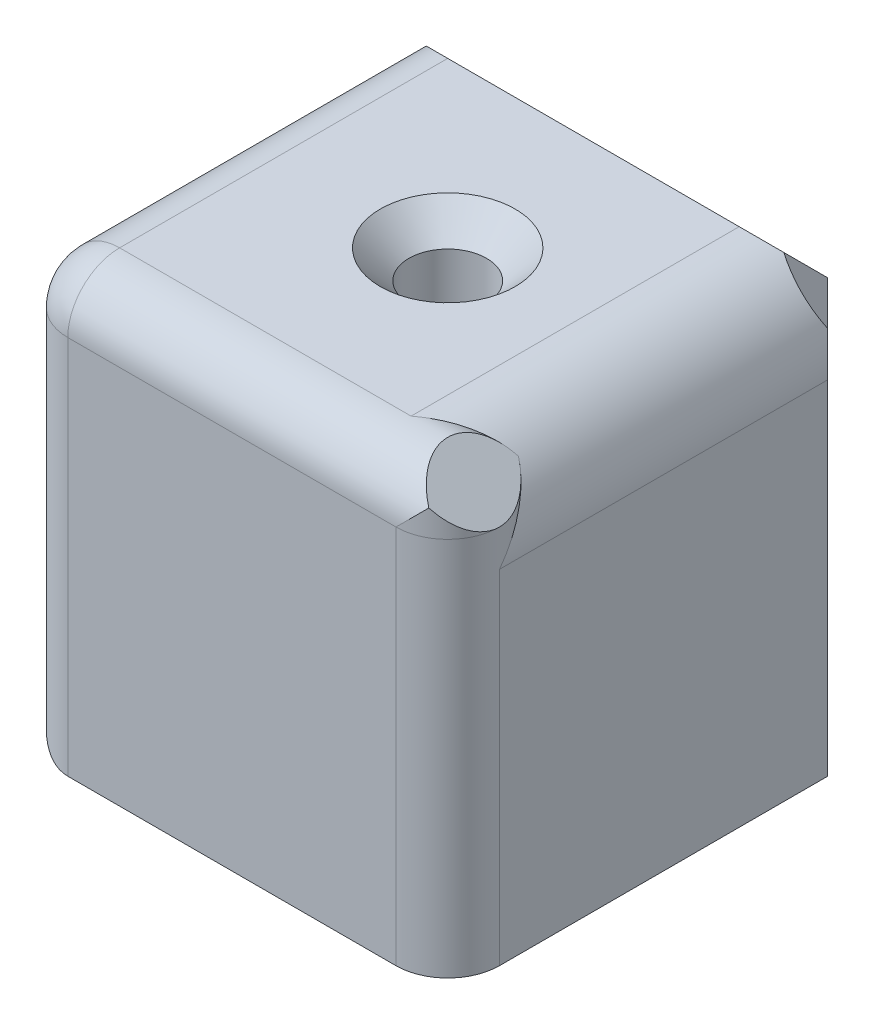
ISO-10303-21;
HEADER;
FILE_DESCRIPTION(('STEP AP214'),'2;1');
FILE_NAME('part.step','',(''),(''),'','','');
FILE_SCHEMA(('AUTOMOTIVE_DESIGN { 1 0 10303 214 1 1 1 1 }'));
ENDSEC;
DATA;
#1=APPLICATION_CONTEXT('core data for automotive mechanical design processes');
#2=APPLICATION_PROTOCOL_DEFINITION('international standard','automotive_design',2000,#1);
#3=PRODUCT_CONTEXT('',#1,'mechanical');
#4=PRODUCT('Part','Part','',(#3));
#5=PRODUCT_RELATED_PRODUCT_CATEGORY('part','',(#4));
#6=PRODUCT_DEFINITION_FORMATION('','',#4);
#7=PRODUCT_DEFINITION_CONTEXT('part definition',#1,'design');
#8=PRODUCT_DEFINITION('design','',#6,#7);
#9=PRODUCT_DEFINITION_SHAPE('','',#8);
#10=(LENGTH_UNIT() NAMED_UNIT(*) SI_UNIT(.MILLI.,.METRE.));
#11=(NAMED_UNIT(*) PLANE_ANGLE_UNIT() SI_UNIT($,.RADIAN.));
#12=(NAMED_UNIT(*) SI_UNIT($,.STERADIAN.) SOLID_ANGLE_UNIT());
#13=UNCERTAINTY_MEASURE_WITH_UNIT(LENGTH_MEASURE(1.E-05),#10,'distance_accuracy_value','');
#14=(GEOMETRIC_REPRESENTATION_CONTEXT(3) GLOBAL_UNCERTAINTY_ASSIGNED_CONTEXT((#13)) GLOBAL_UNIT_ASSIGNED_CONTEXT((#10,
#11,#12)) REPRESENTATION_CONTEXT('',''));
#15=CARTESIAN_POINT('',(0.,0.,0.));
#16=DIRECTION('',(0.,0.,1.));
#17=DIRECTION('',(1.,0.,0.));
#18=AXIS2_PLACEMENT_3D('',#15,#16,#17);
#19=CARTESIAN_POINT('',(19.8786796564403,19.8786796564403,22.));
#20=DIRECTION('',(0.,0.,-1.));
#21=DIRECTION('',(-1.,0.,0.));
#22=AXIS2_PLACEMENT_3D('',#19,#20,#21);
#23=CYLINDRICAL_SURFACE('',#22,5.12132034355965);
#24=CARTESIAN_POINT('',(25.,19.8786796564403,22.));
#25=CARTESIAN_POINT('',(24.9999999929722,19.8824681355446,21.9971004273422));
#26=CARTESIAN_POINT('',(24.9999957893406,19.88625672606,21.9942007656351));
#27=CARTESIAN_POINT('',(24.999199681778,20.2452694775159,21.7194243142326));
#28=CARTESIAN_POINT('',(24.9615105083884,20.601418757666,21.4468411862931));
#29=CARTESIAN_POINT('',(24.8480307816382,21.1301371370946,21.0471031769414));
#30=CARTESIAN_POINT('',(24.8005575269931,21.3058123453278,20.9151196451383));
#31=CARTESIAN_POINT('',(24.6858586342572,21.6542241467728,20.6560457121009));
#32=CARTESIAN_POINT('',(24.6186453894285,21.8269625120411,20.5289522971814));
#33=CARTESIAN_POINT('',(24.4375602877326,22.2254018981608,20.240386083954));
#34=CARTESIAN_POINT('',(24.3156025682009,22.4495250301366,20.0816065124527));
#35=CARTESIAN_POINT('',(24.1036185137131,22.776009364585,19.8586901161403));
#36=CARTESIAN_POINT('',(24.0283313726079,22.882975285724,19.7870807159734));
#37=CARTESIAN_POINT('',(23.8677172932172,23.0931800405642,19.6499372777481));
#38=CARTESIAN_POINT('',(23.7823919522402,23.1964194638296,19.5844022760725));
#39=CARTESIAN_POINT('',(23.5585439900387,23.4460767459297,19.4315414901501));
#40=CARTESIAN_POINT('',(23.4139270543383,23.5898634627181,19.3485389278986));
#41=CARTESIAN_POINT('',(23.1796178565418,23.7956526913762,19.2402916061685));
#42=CARTESIAN_POINT('',(23.0982158111705,23.8628774086252,19.206806389846));
#43=CARTESIAN_POINT('',(22.9297661784687,23.9933077166903,19.1463104846576));
#44=CARTESIAN_POINT('',(22.8427101369166,24.0565069953208,19.1193097888533));
#45=CARTESIAN_POINT('',(22.7529599066656,24.117362836925,19.0960283439823));
#46=B_SPLINE_CURVE_WITH_KNOTS('',3,(#24,#25,#26,#27,#28,#29,#30,#31,#32,#33,#34,#35,#36,#37,#38,
#39,#40,#41,#42,#43,#44,#45),.UNSPECIFIED.,.F.,.F.,(4,2,2,2,2,2,2,2,2,2,4),(0.,
0.0143126857300201,1.35625476494848,2.02998516671267,2.70329348452288,3.60145889395634,
4.04839898127561,4.49526804609127,5.15315207188401,5.48506195913866,5.81748010499694),.UNSPECIFIED.);
#47=CARTESIAN_POINT('',(25.,19.8786796564403,22.));
#48=VERTEX_POINT('',#47);
#49=CARTESIAN_POINT('',(23.5,23.5,19.4019237886467));
#50=VERTEX_POINT('',#49);
#51=EDGE_CURVE('E64',#48,#50,#46,.T.);
#52=ORIENTED_EDGE('',*,*,#51,.F.);
#53=DIRECTION('',(0.,0.,1.));
#54=VECTOR('',#53,1.);
#55=CARTESIAN_POINT('',(25.,19.8786796564403,22.));
#56=LINE('',#55,#54);
#57=CARTESIAN_POINT('',(25.,19.8786796564403,3.));
#58=VERTEX_POINT('',#57);
#59=EDGE_CURVE('E330',#58,#48,#56,.T.);
#60=ORIENTED_EDGE('',*,*,#59,.F.);
#61=CARTESIAN_POINT('',(19.8786796564403,19.8786796564403,-2.12132034355963));
#62=DIRECTION('',(0.707106781186546,0.,-0.707106781186549));
#63=DIRECTION('',(-0.707106781186549,0.,-0.707106781186546));
#64=AXIS2_PLACEMENT_3D('',#61,#62,#63);
#65=ELLIPSE('',#64,7.24264068711929,5.12132034355965);
#66=CARTESIAN_POINT('',(24.5400015785305,22.,2.54000157853047));
#67=VERTEX_POINT('',#66);
#68=EDGE_CURVE('E328',#67,#58,#65,.T.);
#69=ORIENTED_EDGE('',*,*,#68,.F.);
#70=CARTESIAN_POINT('',(19.8786796564403,19.8786796564403,-4.24264068711926));
#71=DIRECTION('',(0.577350269189626,0.577350269189624,-0.577350269189628));
#72=DIRECTION('',(-0.408248290463865,-0.408248290463864,-0.816496580927725));
#73=AXIS2_PLACEMENT_3D('',#70,#71,#72);
#74=ELLIPSE('',#73,8.87038703688139,5.12132034355965);
#75=CARTESIAN_POINT('',(22.,24.5400015785305,2.54000157853047));
#76=VERTEX_POINT('',#75);
#77=EDGE_CURVE('E395',#76,#67,#74,.T.);
#78=ORIENTED_EDGE('',*,*,#77,.F.);
#79=CARTESIAN_POINT('',(19.8786796564403,19.8786796564403,-2.12132034355963));
#80=DIRECTION('',(0.,0.707106781186546,-0.707106781186549));
#81=DIRECTION('',(0.,-0.707106781186549,-0.707106781186546));
#82=AXIS2_PLACEMENT_3D('',#79,#80,#81);
#83=ELLIPSE('',#82,7.24264068711929,5.12132034355965);
#84=CARTESIAN_POINT('',(19.8786796564403,25.,3.));
#85=VERTEX_POINT('',#84);
#86=EDGE_CURVE('E398',#85,#76,#83,.T.);
#87=ORIENTED_EDGE('',*,*,#86,.F.);
#88=DIRECTION('',(0.,0.,1.));
#89=VECTOR('',#88,1.);
#90=CARTESIAN_POINT('',(19.8786796564403,25.,22.));
#91=LINE('',#90,#89);
#92=CARTESIAN_POINT('',(19.8786796564403,25.,22.));
#93=VERTEX_POINT('',#92);
#94=EDGE_CURVE('E401',#93,#85,#91,.F.);
#95=ORIENTED_EDGE('',*,*,#94,.F.);
#96=CARTESIAN_POINT('',(23.8505388344827,23.111674665895,19.213572280283));
#97=CARTESIAN_POINT('',(23.7722863586775,23.2078146527998,19.251949703908));
#98=CARTESIAN_POINT('',(23.6914229891272,23.3000268322801,19.2944830844837));
#99=CARTESIAN_POINT('',(23.5254066893515,23.476448535713,19.3865711111509));
#100=CARTESIAN_POINT('',(23.4402612851467,23.5606713978085,19.436113698056));
#101=CARTESIAN_POINT('',(23.2669359604327,23.7207454315866,19.5407096096895));
#102=CARTESIAN_POINT('',(23.1787807534337,23.7966498802308,19.5957229616464));
#103=CARTESIAN_POINT('',(22.9994578916215,23.9409347962006,19.7106152705213));
#104=CARTESIAN_POINT('',(22.9082884983182,24.009310819333,19.7704970655154));
#105=CARTESIAN_POINT('',(22.6860029994613,24.1649366236184,19.9194008655535));
#106=CARTESIAN_POINT('',(22.5536821482377,24.2485937862713,20.0103913386156));
#107=CARTESIAN_POINT('',(22.2853500847051,24.4019251779575,20.1984777793088));
#108=CARTESIAN_POINT('',(22.1493379045865,24.4715956989087,20.2955753570939));
#109=CARTESIAN_POINT('',(21.8740424185916,24.5977318948334,20.4947645498174));
#110=CARTESIAN_POINT('',(21.734749082798,24.6541490302131,20.5968729159889));
#111=CARTESIAN_POINT('',(21.4541488777255,24.7539216946473,20.8045176411648));
#112=CARTESIAN_POINT('',(21.3128424499226,24.7972800427144,20.9100532548689));
#113=CARTESIAN_POINT('',(20.9592016944187,24.8894917533211,21.1758673641707));
#114=CARTESIAN_POINT('',(20.7459651529588,24.9306417177188,21.3376496913163));
#115=CARTESIAN_POINT('',(20.3184554513284,24.9856190816298,21.6634216887276));
#116=CARTESIAN_POINT('',(20.1041860503327,24.9995123838207,21.8274050672184));
#117=CARTESIAN_POINT('',(19.8862567912125,24.9999957918365,21.9942007120584));
#118=CARTESIAN_POINT('',(19.8824682011739,24.9999999955901,21.9971003735388));
#119=CARTESIAN_POINT('',(19.8786796564403,25.,22.));
#120=B_SPLINE_CURVE_WITH_KNOTS('',3,(#96,#97,#98,#99,#100,#101,#102,#103,#104,#105,#106,#107,
#108,#109,#110,#111,#112,#113,#114,#115,#116,#117,#118,#119),.UNSPECIFIED.,.F.,.F.,(4,2,2,2,2,2,
2,2,2,2,2,4),(0.,0.388991414918305,0.777321538271796,1.16299790303775,1.54890073389045,
2.09131712814461,2.63387713629069,3.17839428779641,3.7227938094872,4.53373733732652,
5.34271769233502,5.35703037806919),.UNSPECIFIED.);
#121=EDGE_CURVE('E12',#93,#50,#120,.F.);
#122=ORIENTED_EDGE('',*,*,#121,.T.);
#123=EDGE_LOOP('',(#52,#60,#69,#78,#87,#95,#122));
#124=FACE_BOUND('',#123,.T.);
#125=ADVANCED_FACE('F49',(#124),#23,.T.);
#126=CARTESIAN_POINT('',(22.,0.,22.));
#127=DIRECTION('',(0.,1.,0.));
#128=DIRECTION('',(0.,0.,1.));
#129=AXIS2_PLACEMENT_3D('',#126,#127,#128);
#130=CYLINDRICAL_SURFACE('',#129,3.);
#131=DIRECTION('',(0.,1.,0.));
#132=VECTOR('',#131,1.);
#133=CARTESIAN_POINT('',(22.,0.,25.));
#134=LINE('',#133,#132);
#135=CARTESIAN_POINT('',(22.,0.,25.));
#136=VERTEX_POINT('',#135);
#137=CARTESIAN_POINT('',(22.,22.,25.));
#138=VERTEX_POINT('',#137);
#139=EDGE_CURVE('E314',#136,#138,#134,.T.);
#140=ORIENTED_EDGE('',*,*,#139,.F.);
#141=CARTESIAN_POINT('',(22.,0.,22.));
#142=DIRECTION('',(0.,1.,0.));
#143=DIRECTION('',(0.,0.,1.));
#144=AXIS2_PLACEMENT_3D('',#141,#142,#143);
#145=CIRCLE('',#144,3.);
#146=CARTESIAN_POINT('',(25.,0.,22.));
#147=VERTEX_POINT('',#146);
#148=EDGE_CURVE('E321',#147,#136,#145,.F.);
#149=ORIENTED_EDGE('',*,*,#148,.F.);
#150=DIRECTION('',(0.,1.,0.));
#151=VECTOR('',#150,1.);
#152=CARTESIAN_POINT('',(25.,0.,22.));
#153=LINE('',#152,#151);
#154=EDGE_CURVE('E324',#48,#147,#153,.F.);
#155=ORIENTED_EDGE('',*,*,#154,.F.);
#156=ORIENTED_EDGE('',*,*,#51,.T.);
#157=CARTESIAN_POINT('',(22.,25.,22.));
#158=DIRECTION('',(-0.707106781186549,-0.707106781186546,0.));
#159=DIRECTION('',(-0.707106781186546,0.707106781186549,0.));
#160=AXIS2_PLACEMENT_3D('',#157,#158,#159);
#161=ELLIPSE('',#160,4.24264068711929,3.);
#162=CARTESIAN_POINT('',(25.,22.,22.));
#163=VERTEX_POINT('',#162);
#164=EDGE_CURVE('E333',#163,#50,#161,.F.);
#165=ORIENTED_EDGE('',*,*,#164,.F.);
#166=CARTESIAN_POINT('',(22.,22.,25.));
#167=CARTESIAN_POINT('',(25.,22.,25.));
#168=CARTESIAN_POINT('',(25.,22.,22.));
#169=(BOUNDED_CURVE() B_SPLINE_CURVE(2,(#166,#167,#168),.UNSPECIFIED.,.F.,
.F.) B_SPLINE_CURVE_WITH_KNOTS((3,3),(0.,1.),
.UNSPECIFIED.) CURVE() GEOMETRIC_REPRESENTATION_ITEM() RATIONAL_B_SPLINE_CURVE((1.,
0.707106781186548,1.)) REPRESENTATION_ITEM(''));
#170=EDGE_CURVE('E360',#138,#163,#169,.T.);
#171=ORIENTED_EDGE('',*,*,#170,.F.);
#172=EDGE_LOOP('',(#140,#149,#155,#156,#165,#171));
#173=FACE_BOUND('',#172,.T.);
#174=ADVANCED_FACE('F343',(#173),#130,.T.);
#175=CARTESIAN_POINT('',(0.,0.,25.));
#176=DIRECTION('',(1.,0.,0.));
#177=DIRECTION('',(0.,0.,-1.));
#178=AXIS2_PLACEMENT_3D('',#175,#176,#177);
#179=PLANE('',#178);
#180=DIRECTION('',(0.,-1.,0.));
#181=VECTOR('',#180,1.);
#182=CARTESIAN_POINT('',(0.,0.,22.));
#183=LINE('',#182,#181);
#184=CARTESIAN_POINT('',(0.,3.,22.));
#185=VERTEX_POINT('',#184);
#186=CARTESIAN_POINT('',(0.,22.,22.));
#187=VERTEX_POINT('',#186);
#188=EDGE_CURVE('E178',#185,#187,#183,.F.);
#189=ORIENTED_EDGE('',*,*,#188,.T.);
#190=DIRECTION('',(0.,0.,-1.));
#191=VECTOR('',#190,1.);
#192=CARTESIAN_POINT('',(0.,22.,25.));
#193=LINE('',#192,#191);
#194=CARTESIAN_POINT('',(0.,22.,3.));
#195=VERTEX_POINT('',#194);
#196=EDGE_CURVE('E155',#187,#195,#193,.T.);
#197=ORIENTED_EDGE('',*,*,#196,.T.);
#198=DIRECTION('',(0.,-1.,0.));
#199=VECTOR('',#198,1.);
#200=CARTESIAN_POINT('',(0.,0.,3.));
#201=LINE('',#200,#199);
#202=CARTESIAN_POINT('',(0.,3.,3.));
#203=VERTEX_POINT('',#202);
#204=EDGE_CURVE('E165',#195,#203,#201,.T.);
#205=ORIENTED_EDGE('',*,*,#204,.T.);
#206=DIRECTION('',(0.,0.,-1.));
#207=VECTOR('',#206,1.);
#208=CARTESIAN_POINT('',(0.,3.,25.));
#209=LINE('',#208,#207);
#210=EDGE_CURVE('E173',#203,#185,#209,.F.);
#211=ORIENTED_EDGE('',*,*,#210,.T.);
#212=EDGE_LOOP('',(#189,#197,#205,#211));
#213=FACE_BOUND('',#212,.T.);
#214=ADVANCED_FACE('F176',(#213),#179,.F.);
#215=CARTESIAN_POINT('',(0.,0.,25.));
#216=DIRECTION('',(0.,1.,0.));
#217=DIRECTION('',(0.,0.,1.));
#218=AXIS2_PLACEMENT_3D('',#215,#216,#217);
#219=PLANE('',#218);
#220=CARTESIAN_POINT('',(12.5,0.,12.5));
#221=DIRECTION('',(0.,1.,0.));
#222=DIRECTION('',(0.,0.,1.));
#223=AXIS2_PLACEMENT_3D('',#220,#221,#222);
#224=CIRCLE('',#223,2.25);
#225=CARTESIAN_POINT('',(12.5,0.,14.75));
#226=VERTEX_POINT('',#225);
#227=EDGE_CURVE('E374',#226,#226,#224,.T.);
#228=ORIENTED_EDGE('',*,*,#227,.T.);
#229=EDGE_LOOP('',(#228));
#230=FACE_BOUND('',#229,.T.);
#231=DIRECTION('',(0.,0.,-1.));
#232=VECTOR('',#231,1.);
#233=CARTESIAN_POINT('',(25.,0.,25.));
#234=LINE('',#233,#232);
#235=CARTESIAN_POINT('',(25.,0.,3.));
#236=VERTEX_POINT('',#235);
#237=EDGE_CURVE('E174',#147,#236,#234,.T.);
#238=ORIENTED_EDGE('',*,*,#237,.F.);
#239=ORIENTED_EDGE('',*,*,#148,.T.);
#240=DIRECTION('',(1.,0.,0.));
#241=VECTOR('',#240,1.);
#242=CARTESIAN_POINT('',(0.,0.,25.));
#243=LINE('',#242,#241);
#244=CARTESIAN_POINT('',(3.,0.,25.));
#245=VERTEX_POINT('',#244);
#246=EDGE_CURVE('E318',#245,#136,#243,.T.);
#247=ORIENTED_EDGE('',*,*,#246,.F.);
#248=DIRECTION('',(0.,0.,-1.));
#249=VECTOR('',#248,1.);
#250=CARTESIAN_POINT('',(3.,0.,25.));
#251=LINE('',#250,#249);
#252=CARTESIAN_POINT('',(3.,0.,0.));
#253=VERTEX_POINT('',#252);
#254=EDGE_CURVE('E199',#245,#253,#251,.T.);
#255=ORIENTED_EDGE('',*,*,#254,.T.);
#256=DIRECTION('',(1.,0.,0.));
#257=VECTOR('',#256,1.);
#258=CARTESIAN_POINT('',(0.,0.,0.));
#259=LINE('',#258,#257);
#260=CARTESIAN_POINT('',(22.,0.,0.));
#261=VERTEX_POINT('',#260);
#262=EDGE_CURVE('E370',#253,#261,#259,.T.);
#263=ORIENTED_EDGE('',*,*,#262,.T.);
#264=DIRECTION('',(0.707106781186549,0.,0.707106781186546));
#265=VECTOR('',#264,1.);
#266=CARTESIAN_POINT('',(25.,0.,3.));
#267=LINE('',#266,#265);
#268=EDGE_CURVE('E233',#261,#236,#267,.T.);
#269=ORIENTED_EDGE('',*,*,#268,.T.);
#270=EDGE_LOOP('',(#238,#239,#247,#255,#263,#269));
#271=FACE_BOUND('',#270,.T.);
#272=ADVANCED_FACE('F351',(#230,#271),#219,.F.);
#273=CARTESIAN_POINT('',(25.,0.,25.));
#274=DIRECTION('',(-1.,0.,0.));
#275=DIRECTION('',(0.,0.,1.));
#276=AXIS2_PLACEMENT_3D('',#273,#274,#275);
#277=PLANE('',#276);
#278=DIRECTION('',(0.,1.,0.));
#279=VECTOR('',#278,1.);
#280=CARTESIAN_POINT('',(25.,25.,3.));
#281=LINE('',#280,#279);
#282=EDGE_CURVE('E205',#236,#58,#281,.T.);
#283=ORIENTED_EDGE('',*,*,#282,.T.);
#284=ORIENTED_EDGE('',*,*,#59,.T.);
#285=ORIENTED_EDGE('',*,*,#154,.T.);
#286=ORIENTED_EDGE('',*,*,#237,.T.);
#287=EDGE_LOOP('',(#283,#284,#285,#286));
#288=FACE_BOUND('',#287,.T.);
#289=ADVANCED_FACE('F420',(#288),#277,.F.);
#290=CARTESIAN_POINT('',(0.,25.,25.));
#291=DIRECTION('',(0.,-1.,0.));
#292=DIRECTION('',(0.,0.,-1.));
#293=AXIS2_PLACEMENT_3D('',#290,#291,#292);
#294=PLANE('',#293);
#295=CARTESIAN_POINT('',(12.5,25.,12.5));
#296=DIRECTION('',(0.,1.,0.));
#297=DIRECTION('',(0.,0.,1.));
#298=AXIS2_PLACEMENT_3D('',#295,#296,#297);
#299=CIRCLE('',#298,3.9);
#300=CARTESIAN_POINT('',(12.5,25.,16.4));
#301=VERTEX_POINT('',#300);
#302=EDGE_CURVE('E223',#301,#301,#299,.T.);
#303=ORIENTED_EDGE('',*,*,#302,.F.);
#304=EDGE_LOOP('',(#303));
#305=FACE_BOUND('',#304,.T.);
#306=DIRECTION('',(-1.,0.,0.));
#307=VECTOR('',#306,1.);
#308=CARTESIAN_POINT('',(0.,25.,22.));
#309=LINE('',#308,#307);
#310=CARTESIAN_POINT('',(3.,25.,22.));
#311=VERTEX_POINT('',#310);
#312=EDGE_CURVE('E181',#311,#93,#309,.F.);
#313=ORIENTED_EDGE('',*,*,#312,.T.);
#314=ORIENTED_EDGE('',*,*,#94,.T.);
#315=DIRECTION('',(-1.,0.,0.));
#316=VECTOR('',#315,1.);
#317=CARTESIAN_POINT('',(3.,25.,3.));
#318=LINE('',#317,#316);
#319=CARTESIAN_POINT('',(3.,25.,3.));
#320=VERTEX_POINT('',#319);
#321=EDGE_CURVE('E237',#85,#320,#318,.T.);
#322=ORIENTED_EDGE('',*,*,#321,.T.);
#323=DIRECTION('',(0.,0.,-1.));
#324=VECTOR('',#323,1.);
#325=CARTESIAN_POINT('',(3.,25.,25.));
#326=LINE('',#325,#324);
#327=EDGE_CURVE('E186',#320,#311,#326,.F.);
#328=ORIENTED_EDGE('',*,*,#327,.T.);
#329=EDGE_LOOP('',(#313,#314,#322,#328));
#330=FACE_BOUND('',#329,.T.);
#331=ADVANCED_FACE('F430',(#305,#330),#294,.F.);
#332=CARTESIAN_POINT('',(0.,0.,25.));
#333=DIRECTION('',(0.,0.,-1.));
#334=DIRECTION('',(-1.,0.,0.));
#335=AXIS2_PLACEMENT_3D('',#332,#333,#334);
#336=PLANE('',#335);
#337=ORIENTED_EDGE('',*,*,#246,.T.);
#338=ORIENTED_EDGE('',*,*,#139,.T.);
#339=DIRECTION('',(-1.,0.,0.));
#340=VECTOR('',#339,1.);
#341=CARTESIAN_POINT('',(0.,22.,25.));
#342=LINE('',#341,#340);
#343=CARTESIAN_POINT('',(3.,22.,25.));
#344=VERTEX_POINT('',#343);
#345=EDGE_CURVE('E193',#138,#344,#342,.T.);
#346=ORIENTED_EDGE('',*,*,#345,.T.);
#347=DIRECTION('',(0.,-1.,0.));
#348=VECTOR('',#347,1.);
#349=CARTESIAN_POINT('',(3.,0.,25.));
#350=LINE('',#349,#348);
#351=EDGE_CURVE('E196',#344,#245,#350,.T.);
#352=ORIENTED_EDGE('',*,*,#351,.T.);
#353=EDGE_LOOP('',(#337,#338,#346,#352));
#354=FACE_BOUND('',#353,.T.);
#355=ADVANCED_FACE('F365',(#354),#336,.F.);
#356=CARTESIAN_POINT('',(0.,0.,0.));
#357=DIRECTION('',(0.,0.,-1.));
#358=DIRECTION('',(-1.,0.,0.));
#359=AXIS2_PLACEMENT_3D('',#356,#357,#358);
#360=PLANE('',#359);
#361=DIRECTION('',(1.,0.,0.));
#362=VECTOR('',#361,1.);
#363=CARTESIAN_POINT('',(25.,22.,0.));
#364=LINE('',#363,#362);
#365=CARTESIAN_POINT('',(3.,22.,0.));
#366=VERTEX_POINT('',#365);
#367=CARTESIAN_POINT('',(22.,22.,0.));
#368=VERTEX_POINT('',#367);
#369=EDGE_CURVE('E227',#366,#368,#364,.T.);
#370=ORIENTED_EDGE('',*,*,#369,.T.);
#371=DIRECTION('',(0.,-1.,0.));
#372=VECTOR('',#371,1.);
#373=CARTESIAN_POINT('',(22.,0.,0.));
#374=LINE('',#373,#372);
#375=EDGE_CURVE('E230',#368,#261,#374,.T.);
#376=ORIENTED_EDGE('',*,*,#375,.T.);
#377=ORIENTED_EDGE('',*,*,#262,.F.);
#378=DIRECTION('',(0.,-1.,0.));
#379=VECTOR('',#378,1.);
#380=CARTESIAN_POINT('',(3.,25.,0.));
#381=LINE('',#380,#379);
#382=EDGE_CURVE('E202',#253,#366,#381,.F.);
#383=ORIENTED_EDGE('',*,*,#382,.T.);
#384=EDGE_LOOP('',(#370,#376,#377,#383));
#385=FACE_BOUND('',#384,.T.);
#386=ADVANCED_FACE('F387',(#385),#360,.T.);
#387=CARTESIAN_POINT('',(12.5,25.,12.5));
#388=DIRECTION('',(0.,1.,0.));
#389=DIRECTION('',(0.,0.,1.));
#390=AXIS2_PLACEMENT_3D('',#387,#388,#389);
#391=CYLINDRICAL_SURFACE('',#390,2.25);
#392=ORIENTED_EDGE('',*,*,#227,.F.);
#393=EDGE_LOOP('',(#392));
#394=FACE_BOUND('',#393,.T.);
#395=CARTESIAN_POINT('',(12.5,23.35,12.5));
#396=DIRECTION('',(0.,1.,0.));
#397=DIRECTION('',(0.,0.,1.));
#398=AXIS2_PLACEMENT_3D('',#395,#396,#397);
#399=CIRCLE('',#398,2.25);
#400=CARTESIAN_POINT('',(12.5,23.35,14.75));
#401=VERTEX_POINT('',#400);
#402=EDGE_CURVE('E589',#401,#401,#399,.T.);
#403=ORIENTED_EDGE('',*,*,#402,.T.);
#404=EDGE_LOOP('',(#403));
#405=FACE_BOUND('',#404,.T.);
#406=ADVANCED_FACE('F469',(#394,#405),#391,.F.);
#407=CARTESIAN_POINT('',(12.5,25.,12.5));
#408=DIRECTION('',(0.,1.,0.));
#409=DIRECTION('',(0.,0.,1.));
#410=AXIS2_PLACEMENT_3D('',#407,#408,#409);
#411=CONICAL_SURFACE('',#410,3.9,0.785398163397443);
#412=ORIENTED_EDGE('',*,*,#402,.F.);
#413=EDGE_LOOP('',(#412));
#414=FACE_BOUND('',#413,.T.);
#415=ORIENTED_EDGE('',*,*,#302,.T.);
#416=EDGE_LOOP('',(#415));
#417=FACE_BOUND('',#416,.T.);
#418=ADVANCED_FACE('F276',(#414,#417),#411,.F.);
#419=CARTESIAN_POINT('',(0.,22.,22.));
#420=DIRECTION('',(-1.,0.,0.));
#421=DIRECTION('',(0.,0.,1.));
#422=AXIS2_PLACEMENT_3D('',#419,#420,#421);
#423=CYLINDRICAL_SURFACE('',#422,3.);
#424=ORIENTED_EDGE('',*,*,#345,.F.);
#425=CARTESIAN_POINT('',(23.5,23.5,24.5980762113533));
#426=CARTESIAN_POINT('',(23.4020166248769,23.402016624876,24.6546062484635));
#427=CARTESIAN_POINT('',(23.3022766291096,23.3022766291092,24.7048455522806));
#428=CARTESIAN_POINT('',(23.1001727006653,23.1001727006657,24.7931756542342));
#429=CARTESIAN_POINT('',(22.9978097056298,22.9978097056307,24.8312707298724));
#430=CARTESIAN_POINT('',(22.791826210854,22.791826210853,24.8956135681224));
#431=CARTESIAN_POINT('',(22.6882152541192,22.6882152541159,24.921923065344));
#432=CARTESIAN_POINT('',(22.4799009434026,22.4799009434057,24.9632706059082));
#433=CARTESIAN_POINT('',(22.3751978166294,22.3751978166413,24.9783109480055));
#434=CARTESIAN_POINT('',(22.1828556471661,22.1828556471712,24.9957068601632));
#435=CARTESIAN_POINT('',(22.0952932131543,22.0952932131477,24.9997639917823));
#436=CARTESIAN_POINT('',(22.005163962974,22.0051639629736,24.9999966655729));
#437=CARTESIAN_POINT('',(22.0025819724656,22.0025819724654,24.9999999987797));
#438=CARTESIAN_POINT('',(22.,22.,25.));
#439=B_SPLINE_CURVE_WITH_KNOTS('',3,(#425,#426,#427,#428,#429,#430,#431,#432,#433,#434,#435,
#436,#437,#438),.UNSPECIFIED.,.F.,.F.,(4,2,2,2,2,2,4),(0.,0.448707298817575,0.897256376598672,
1.34342759780383,1.78950778134192,2.16093731388708,2.17189176960155),.UNSPECIFIED.);
#440=CARTESIAN_POINT('',(23.5,23.5,24.5980762113533));
#441=VERTEX_POINT('',#440);
#442=EDGE_CURVE('E247',#138,#441,#439,.F.);
#443=ORIENTED_EDGE('',*,*,#442,.T.);
#444=CARTESIAN_POINT('',(25.,22.,22.));
#445=DIRECTION('',(-0.707106781186549,-0.707106781186546,0.));
#446=DIRECTION('',(-0.707106781186546,0.707106781186549,0.));
#447=AXIS2_PLACEMENT_3D('',#444,#445,#446);
#448=ELLIPSE('',#447,4.24264068711928,3.);
#449=EDGE_CURVE('E71',#441,#50,#448,.T.);
#450=ORIENTED_EDGE('',*,*,#449,.T.);
#451=ORIENTED_EDGE('',*,*,#121,.F.);
#452=ORIENTED_EDGE('',*,*,#312,.F.);
#453=CARTESIAN_POINT('',(3.,22.,22.));
#454=DIRECTION('',(-1.,0.,0.));
#455=DIRECTION('',(0.,0.,1.));
#456=AXIS2_PLACEMENT_3D('',#453,#454,#455);
#457=CIRCLE('',#456,3.);
#458=EDGE_CURVE('E215',#344,#311,#457,.T.);
#459=ORIENTED_EDGE('',*,*,#458,.F.);
#460=EDGE_LOOP('',(#424,#443,#450,#451,#452,#459));
#461=FACE_BOUND('',#460,.T.);
#462=ADVANCED_FACE('F270',(#461),#423,.T.);
#463=CARTESIAN_POINT('',(3.,0.,22.));
#464=DIRECTION('',(0.,-1.,0.));
#465=DIRECTION('',(0.,0.,-1.));
#466=AXIS2_PLACEMENT_3D('',#463,#464,#465);
#467=CYLINDRICAL_SURFACE('',#466,3.);
#468=CARTESIAN_POINT('',(3.,22.,22.));
#469=DIRECTION('',(0.,1.,0.));
#470=DIRECTION('',(0.,0.,1.));
#471=AXIS2_PLACEMENT_3D('',#468,#469,#470);
#472=CIRCLE('',#471,3.);
#473=EDGE_CURVE('E211',#187,#344,#472,.T.);
#474=ORIENTED_EDGE('',*,*,#473,.F.);
#475=ORIENTED_EDGE('',*,*,#188,.F.);
#476=CARTESIAN_POINT('',(3.,3.,22.));
#477=DIRECTION('',(0.,-0.707106781186547,-0.707106781186547));
#478=DIRECTION('',(0.,0.707106781186547,-0.707106781186547));
#479=AXIS2_PLACEMENT_3D('',#476,#477,#478);
#480=ELLIPSE('',#479,4.24264068711928,3.);
#481=EDGE_CURVE('E219',#245,#185,#480,.T.);
#482=ORIENTED_EDGE('',*,*,#481,.F.);
#483=ORIENTED_EDGE('',*,*,#351,.F.);
#484=EDGE_LOOP('',(#474,#475,#482,#483));
#485=FACE_BOUND('',#484,.T.);
#486=ADVANCED_FACE('F275',(#485),#467,.T.);
#487=CARTESIAN_POINT('',(3.,3.,25.));
#488=DIRECTION('',(0.,0.,-1.));
#489=DIRECTION('',(-1.,0.,0.));
#490=AXIS2_PLACEMENT_3D('',#487,#488,#489);
#491=CYLINDRICAL_SURFACE('',#490,3.);
#492=ORIENTED_EDGE('',*,*,#481,.T.);
#493=ORIENTED_EDGE('',*,*,#210,.F.);
#494=CARTESIAN_POINT('',(3.,3.,3.));
#495=DIRECTION('',(0.,0.707106781186547,-0.707106781186547));
#496=DIRECTION('',(0.,0.707106781186547,0.707106781186547));
#497=AXIS2_PLACEMENT_3D('',#494,#495,#496);
#498=ELLIPSE('',#497,4.24264068711928,3.);
#499=EDGE_CURVE('E169',#253,#203,#498,.T.);
#500=ORIENTED_EDGE('',*,*,#499,.F.);
#501=ORIENTED_EDGE('',*,*,#254,.F.);
#502=EDGE_LOOP('',(#492,#493,#500,#501));
#503=FACE_BOUND('',#502,.T.);
#504=ADVANCED_FACE('F383',(#503),#491,.T.);
#505=CARTESIAN_POINT('',(3.,22.,22.));
#506=DIRECTION('',(0.,0.,1.));
#507=DIRECTION('',(1.,0.,0.));
#508=AXIS2_PLACEMENT_3D('',#505,#506,#507);
#509=SPHERICAL_SURFACE('',#508,3.);
#510=ORIENTED_EDGE('',*,*,#473,.T.);
#511=ORIENTED_EDGE('',*,*,#458,.T.);
#512=CARTESIAN_POINT('',(3.,22.,22.));
#513=DIRECTION('',(0.,0.,1.));
#514=DIRECTION('',(1.,0.,0.));
#515=AXIS2_PLACEMENT_3D('',#512,#513,#514);
#516=CIRCLE('',#515,3.);
#517=EDGE_CURVE('E161',#187,#311,#516,.F.);
#518=ORIENTED_EDGE('',*,*,#517,.F.);
#519=EDGE_LOOP('',(#510,#511,#518));
#520=FACE_BOUND('',#519,.T.);
#521=ADVANCED_FACE('F426',(#520),#509,.T.);
#522=CARTESIAN_POINT('',(3.,0.,3.));
#523=DIRECTION('',(0.,1.,0.));
#524=DIRECTION('',(0.,0.,1.));
#525=AXIS2_PLACEMENT_3D('',#522,#523,#524);
#526=CYLINDRICAL_SURFACE('',#525,3.);
#527=CARTESIAN_POINT('',(3.,22.,3.));
#528=DIRECTION('',(0.,0.707106781186547,0.707106781186547));
#529=DIRECTION('',(0.,0.707106781186547,-0.707106781186547));
#530=AXIS2_PLACEMENT_3D('',#527,#528,#529);
#531=ELLIPSE('',#530,4.24264068711928,3.);
#532=CARTESIAN_POINT('',(0.401923788646682,23.5,1.5));
#533=VERTEX_POINT('',#532);
#534=EDGE_CURVE('E149',#533,#195,#531,.T.);
#535=ORIENTED_EDGE('',*,*,#534,.F.);
#536=CARTESIAN_POINT('',(3.,25.,3.));
#537=DIRECTION('',(0.,0.707106781186546,-0.707106781186549));
#538=DIRECTION('',(0.,0.707106781186549,0.707106781186546));
#539=AXIS2_PLACEMENT_3D('',#536,#537,#538);
#540=ELLIPSE('',#539,4.24264068711929,3.);
#541=EDGE_CURVE('E244',#533,#366,#540,.F.);
#542=ORIENTED_EDGE('',*,*,#541,.T.);
#543=ORIENTED_EDGE('',*,*,#382,.F.);
#544=ORIENTED_EDGE('',*,*,#499,.T.);
#545=ORIENTED_EDGE('',*,*,#204,.F.);
#546=EDGE_LOOP('',(#535,#542,#543,#544,#545));
#547=FACE_BOUND('',#546,.T.);
#548=ADVANCED_FACE('F166',(#547),#526,.T.);
#549=CARTESIAN_POINT('',(3.,22.,25.));
#550=DIRECTION('',(0.,0.,-1.));
#551=DIRECTION('',(-1.,0.,0.));
#552=AXIS2_PLACEMENT_3D('',#549,#550,#551);
#553=CYLINDRICAL_SURFACE('',#552,3.);
#554=ORIENTED_EDGE('',*,*,#327,.F.);
#555=CARTESIAN_POINT('',(3.,22.,0.));
#556=DIRECTION('',(0.,0.707106781186546,-0.707106781186549));
#557=DIRECTION('',(0.,-0.707106781186549,-0.707106781186546));
#558=AXIS2_PLACEMENT_3D('',#555,#556,#557);
#559=ELLIPSE('',#558,4.24264068711928,3.);
#560=EDGE_CURVE('E157',#320,#533,#559,.F.);
#561=ORIENTED_EDGE('',*,*,#560,.T.);
#562=ORIENTED_EDGE('',*,*,#534,.T.);
#563=ORIENTED_EDGE('',*,*,#196,.F.);
#564=ORIENTED_EDGE('',*,*,#517,.T.);
#565=EDGE_LOOP('',(#554,#561,#562,#563,#564));
#566=FACE_BOUND('',#565,.T.);
#567=ADVANCED_FACE('F152',(#566),#553,.T.);
#568=CARTESIAN_POINT('',(22.,25.,25.));
#569=DIRECTION('',(-0.707106781186549,-0.707106781186546,0.));
#570=DIRECTION('',(0.,0.,-1.));
#571=AXIS2_PLACEMENT_3D('',#568,#569,#570);
#572=PLANE('',#571);
#573=CARTESIAN_POINT('',(23.5,23.5,24.5980762113533));
#574=CARTESIAN_POINT('',(23.5802627268017,23.4197372731984,24.5517157111793));
#575=CARTESIAN_POINT('',(23.6593522202638,23.3406477797362,24.5011106064797));
#576=CARTESIAN_POINT('',(23.8146034680262,23.1853965319738,24.3908861375505));
#577=CARTESIAN_POINT('',(23.8907560826966,23.1092439173034,24.3312410986532));
#578=CARTESIAN_POINT('',(24.0399921372412,22.9600078627588,24.2018836085196));
#579=CARTESIAN_POINT('',(24.1130261850579,22.8869738149421,24.1320561429828));
#580=CARTESIAN_POINT('',(24.2537980965945,22.7462019034055,23.9826547458752));
#581=CARTESIAN_POINT('',(24.3215427360561,22.6784572639438,23.9030936301929));
#582=CARTESIAN_POINT('',(24.4655683155778,22.534431684422,23.714112585493));
#583=CARTESIAN_POINT('',(24.540151718598,22.459848281402,23.6020575825899));
#584=CARTESIAN_POINT('',(24.6758728142076,22.3241271857924,23.3632566602028));
#585=CARTESIAN_POINT('',(24.737064928616,22.2629350713841,23.2365735241938));
#586=CARTESIAN_POINT('',(24.8345169653253,22.1654830346747,22.9900765693446));
#587=CARTESIAN_POINT('',(24.8731585635133,22.1268414364867,22.8721746872836));
#588=CARTESIAN_POINT('',(24.920281827555,22.0797181724449,22.6898617088617));
#589=CARTESIAN_POINT('',(24.934182109562,22.065817890438,22.6281879059583));
#590=CARTESIAN_POINT('',(24.9581486313959,22.0418513686041,22.5033766940414));
#591=CARTESIAN_POINT('',(24.9682164443904,22.0317835556096,22.4402398968789));
#592=CARTESIAN_POINT('',(24.9841281989542,22.0158718010458,22.3144758302972));
#593=CARTESIAN_POINT('',(24.990067819334,22.009932180666,22.2518727697994));
#594=CARTESIAN_POINT('',(24.9980098076571,22.0019901923429,22.1261832115451));
#595=CARTESIAN_POINT('',(25.0000129656039,21.9999870343961,22.063096813341));
#596=CARTESIAN_POINT('',(25.,22.,22.));
#597=B_SPLINE_CURVE_WITH_KNOTS('',3,(#573,#574,#575,#576,#577,#578,#579,#580,#581,#582,#583,
#584,#585,#586,#587,#588,#589,#590,#591,#592,#593,#594,#595,#596),.UNSPECIFIED.,.F.,.F.,(4,2,2,
2,2,2,2,2,2,2,2,4),(0.,0.367850648747747,0.736766330950357,1.11022863547447,1.48320440552359,
1.943224358219,2.40133857650486,2.78939843386505,2.98338489821233,3.17729164811546,
3.36653919485409,3.55574875786444),.UNSPECIFIED.);
#598=EDGE_CURVE('E262',#441,#163,#597,.T.);
#599=ORIENTED_EDGE('',*,*,#598,.T.);
#600=ORIENTED_EDGE('',*,*,#164,.T.);
#601=ORIENTED_EDGE('',*,*,#449,.F.);
#602=EDGE_LOOP('',(#599,#600,#601));
#603=FACE_BOUND('',#602,.T.);
#604=ADVANCED_FACE('F299',(#603),#572,.F.);
#605=CARTESIAN_POINT('',(0.,25.,3.));
#606=DIRECTION('',(0.,0.707106781186546,-0.707106781186549));
#607=DIRECTION('',(1.,0.,0.));
#608=AXIS2_PLACEMENT_3D('',#605,#606,#607);
#609=PLANE('',#608);
#610=ORIENTED_EDGE('',*,*,#321,.F.);
#611=ORIENTED_EDGE('',*,*,#86,.T.);
#612=DIRECTION('',(0.,0.707106781186549,0.707106781186546));
#613=VECTOR('',#612,1.);
#614=CARTESIAN_POINT('',(22.,23.5,1.5));
#615=LINE('',#614,#613);
#616=EDGE_CURVE('E162',#368,#76,#615,.T.);
#617=ORIENTED_EDGE('',*,*,#616,.F.);
#618=ORIENTED_EDGE('',*,*,#369,.F.);
#619=ORIENTED_EDGE('',*,*,#541,.F.);
#620=ORIENTED_EDGE('',*,*,#560,.F.);
#621=EDGE_LOOP('',(#610,#611,#617,#618,#619,#620));
#622=FACE_BOUND('',#621,.T.);
#623=ADVANCED_FACE('F293',(#622),#609,.T.);
#624=CARTESIAN_POINT('',(25.,22.,3.));
#625=DIRECTION('',(0.577350269189626,0.577350269189624,-0.577350269189628));
#626=DIRECTION('',(-0.707106781186549,0.,-0.707106781186546));
#627=AXIS2_PLACEMENT_3D('',#624,#625,#626);
#628=PLANE('',#627);
#629=ORIENTED_EDGE('',*,*,#616,.T.);
#630=ORIENTED_EDGE('',*,*,#77,.T.);
#631=DIRECTION('',(-0.707106781186549,0.,-0.707106781186546));
#632=VECTOR('',#631,1.);
#633=CARTESIAN_POINT('',(25.,22.,3.));
#634=LINE('',#633,#632);
#635=EDGE_CURVE('E248',#368,#67,#634,.F.);
#636=ORIENTED_EDGE('',*,*,#635,.F.);
#637=EDGE_LOOP('',(#629,#630,#636));
#638=FACE_BOUND('',#637,.T.);
#639=ADVANCED_FACE('F286',(#638),#628,.T.);
#640=CARTESIAN_POINT('',(25.,0.,3.));
#641=DIRECTION('',(0.707106781186546,0.,-0.707106781186549));
#642=DIRECTION('',(0.,-1.,0.));
#643=AXIS2_PLACEMENT_3D('',#640,#641,#642);
#644=PLANE('',#643);
#645=ORIENTED_EDGE('',*,*,#635,.T.);
#646=ORIENTED_EDGE('',*,*,#68,.T.);
#647=ORIENTED_EDGE('',*,*,#282,.F.);
#648=ORIENTED_EDGE('',*,*,#268,.F.);
#649=ORIENTED_EDGE('',*,*,#375,.F.);
#650=EDGE_LOOP('',(#645,#646,#647,#648,#649));
#651=FACE_BOUND('',#650,.T.);
#652=ADVANCED_FACE('F279',(#651),#644,.T.);
#653=CARTESIAN_POINT('',(24.,-4.7282,25.));
#654=CARTESIAN_POINT('',(24.,-3.15213333333333,25.));
#655=CARTESIAN_POINT('',(24.,-1.57606666666667,25.));
#656=CARTESIAN_POINT('',(24.,0.,25.));
#657=CARTESIAN_POINT('',(24.,7.33333333333333,25.));
#658=CARTESIAN_POINT('',(22.,14.6666666666667,25.));
#659=CARTESIAN_POINT('',(22.,22.,25.));
#660=CARTESIAN_POINT('',(22.,24.1230666666667,25.));
#661=CARTESIAN_POINT('',(22.,26.2461333333333,25.));
#662=CARTESIAN_POINT('',(22.,28.3692,25.));
#663=CARTESIAN_POINT('',(25.,-4.7282,25.));
#664=CARTESIAN_POINT('',(25.,-3.15213333333333,25.));
#665=CARTESIAN_POINT('',(25.,-1.57606666666667,25.));
#666=CARTESIAN_POINT('',(25.,0.,25.));
#667=CARTESIAN_POINT('',(25.,7.33333333333333,25.));
#668=CARTESIAN_POINT('',(25.,14.6666666666667,25.));
#669=CARTESIAN_POINT('',(25.,22.,25.));
#670=CARTESIAN_POINT('',(25.,24.1230666666667,25.));
#671=CARTESIAN_POINT('',(25.,26.2461333333333,25.));
#672=CARTESIAN_POINT('',(25.,28.3692,25.));
#673=CARTESIAN_POINT('',(25.,-4.7282,24.));
#674=CARTESIAN_POINT('',(25.,-3.15213333333333,24.));
#675=CARTESIAN_POINT('',(25.,-1.57606666666667,24.));
#676=CARTESIAN_POINT('',(25.,0.,24.));
#677=CARTESIAN_POINT('',(25.,7.33333333333333,24.));
#678=CARTESIAN_POINT('',(25.,14.6666666666667,22.));
#679=CARTESIAN_POINT('',(25.,22.,22.));
#680=CARTESIAN_POINT('',(25.,24.1230666666667,22.));
#681=CARTESIAN_POINT('',(25.,26.2461333333333,22.));
#682=CARTESIAN_POINT('',(25.,28.3692,22.));
#683=(BOUNDED_SURFACE() B_SPLINE_SURFACE(2,3,((#653,#654,#655,#656,#657,#658,#659,#660,#661,
#662),(#663,#664,#665,#666,#667,#668,#669,#670,#671,#672),(#673,#674,#675,#676,#677,#678,#679,
#680,#681,#682)),.UNSPECIFIED.,.F.,.F.,.F.) B_SPLINE_SURFACE_WITH_KNOTS((3,3),(4,3,3,4),(0.,1.),
(-0.00472819999999999,0.,0.022,0.0283692),
.UNSPECIFIED.) GEOMETRIC_REPRESENTATION_ITEM() RATIONAL_B_SPLINE_SURFACE(((1.,1.,1.,1.,1.,1.,1.,
1.,1.,1.),(0.707106781186548,0.707106781186548,0.707106781186548,0.707106781186548,
0.707106781186548,0.707106781186548,0.707106781186548,0.707106781186548,0.707106781186548,
0.707106781186548),(1.,1.,1.,1.,1.,1.,1.,1.,1.,1.))) REPRESENTATION_ITEM('') SURFACE());
#684=ORIENTED_EDGE('',*,*,#442,.F.);
#685=ORIENTED_EDGE('',*,*,#170,.T.);
#686=ORIENTED_EDGE('',*,*,#598,.F.);
#687=EDGE_LOOP('',(#684,#685,#686));
#688=FACE_BOUND('',#687,.T.);
#689=ADVANCED_FACE('F265',(#688),#683,.T.);
#690=CLOSED_SHELL('',(#125,#174,#214,#272,#289,#331,#355,#386,#406,#418,#462,#486,#504,#521,
#548,#567,#604,#623,#639,#652,#689));
#691=MANIFOLD_SOLID_BREP('B2',#690);
#692=ADVANCED_BREP_SHAPE_REPRESENTATION('',(#18,#691),#14);
#693=SHAPE_DEFINITION_REPRESENTATION(#9,#692);
ENDSEC;
END-ISO-10303-21;
